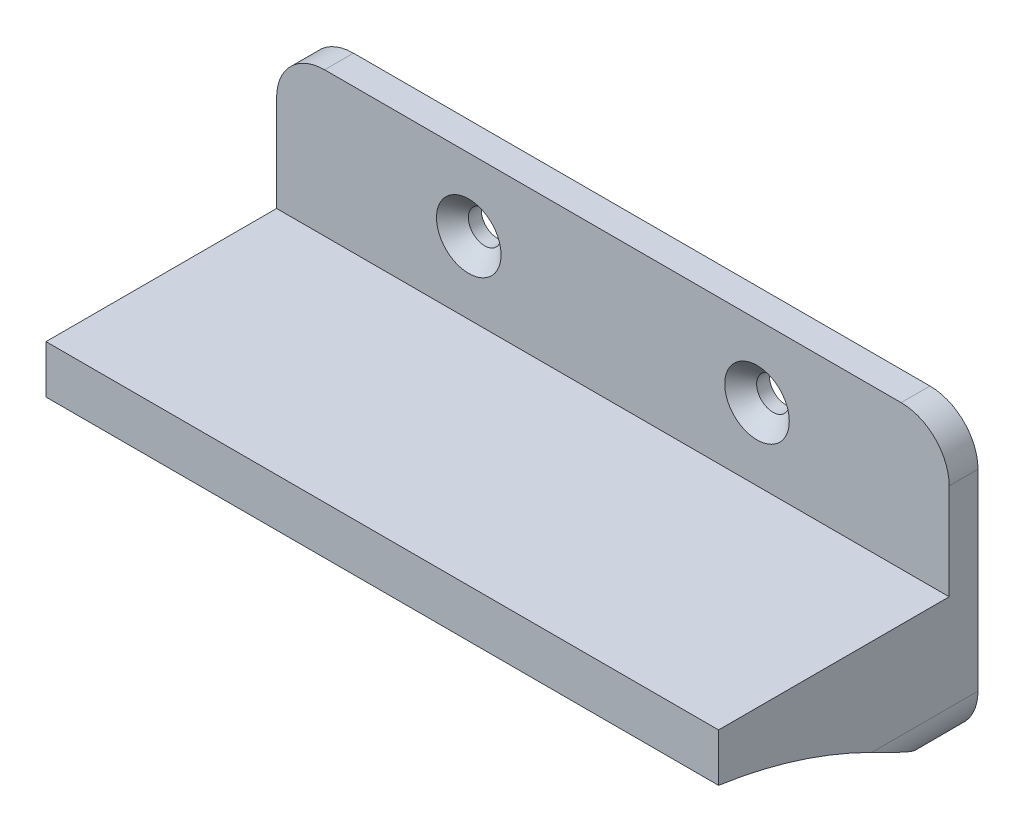
ISO-10303-21;
HEADER;
FILE_DESCRIPTION(('STEP AP214'),'2;1');
FILE_NAME('part.step','',(''),(''),'','','');
FILE_SCHEMA(('AUTOMOTIVE_DESIGN { 1 0 10303 214 1 1 1 1 }'));
ENDSEC;
DATA;
#1=APPLICATION_CONTEXT('core data for automotive mechanical design processes');
#2=APPLICATION_PROTOCOL_DEFINITION('international standard','automotive_design',2000,#1);
#3=PRODUCT_CONTEXT('',#1,'mechanical');
#4=PRODUCT('Part','Part','',(#3));
#5=PRODUCT_RELATED_PRODUCT_CATEGORY('part','',(#4));
#6=PRODUCT_DEFINITION_FORMATION('','',#4);
#7=PRODUCT_DEFINITION_CONTEXT('part definition',#1,'design');
#8=PRODUCT_DEFINITION('design','',#6,#7);
#9=PRODUCT_DEFINITION_SHAPE('','',#8);
#10=(LENGTH_UNIT() NAMED_UNIT(*) SI_UNIT(.MILLI.,.METRE.));
#11=(NAMED_UNIT(*) PLANE_ANGLE_UNIT() SI_UNIT($,.RADIAN.));
#12=(NAMED_UNIT(*) SI_UNIT($,.STERADIAN.) SOLID_ANGLE_UNIT());
#13=UNCERTAINTY_MEASURE_WITH_UNIT(LENGTH_MEASURE(1.E-05),#10,'distance_accuracy_value','');
#14=(GEOMETRIC_REPRESENTATION_CONTEXT(3) GLOBAL_UNCERTAINTY_ASSIGNED_CONTEXT((#13)) GLOBAL_UNIT_ASSIGNED_CONTEXT((#10,
#11,#12)) REPRESENTATION_CONTEXT('',''));
#15=CARTESIAN_POINT('',(0.,0.,0.));
#16=DIRECTION('',(0.,0.,1.));
#17=DIRECTION('',(1.,0.,0.));
#18=AXIS2_PLACEMENT_3D('',#15,#16,#17);
#19=CARTESIAN_POINT('',(0.,0.,3.));
#20=DIRECTION('',(0.,0.,1.));
#21=DIRECTION('',(1.,0.,0.));
#22=AXIS2_PLACEMENT_3D('',#19,#20,#21);
#23=PLANE('',#22);
#24=CARTESIAN_POINT('',(-9.92366412213741,7.99618320610687,3.));
#25=DIRECTION('',(0.,0.,1.));
#26=DIRECTION('',(1.,0.,0.));
#27=AXIS2_PLACEMENT_3D('',#24,#25,#26);
#28=CIRCLE('',#27,3.36);
#29=CARTESIAN_POINT('',(-6.56366412213741,7.99618320610687,3.));
#30=VERTEX_POINT('',#29);
#31=EDGE_CURVE('E459',#30,#30,#28,.T.);
#32=ORIENTED_EDGE('',*,*,#31,.F.);
#33=EDGE_LOOP('',(#32));
#34=FACE_BOUND('',#33,.T.);
#35=CARTESIAN_POINT('',(20.0763358778626,7.99618320610689,3.));
#36=DIRECTION('',(0.,0.,1.));
#37=DIRECTION('',(1.,0.,0.));
#38=AXIS2_PLACEMENT_3D('',#35,#36,#37);
#39=CIRCLE('',#38,3.36);
#40=CARTESIAN_POINT('',(23.4363358778626,7.99618320610689,3.));
#41=VERTEX_POINT('',#40);
#42=EDGE_CURVE('E450',#41,#41,#39,.T.);
#43=ORIENTED_EDGE('',*,*,#42,.F.);
#44=EDGE_LOOP('',(#43));
#45=FACE_BOUND('',#44,.T.);
#46=DIRECTION('',(0.,1.,0.));
#47=VECTOR('',#46,1.);
#48=CARTESIAN_POINT('',(40.0763358778626,15.4961832061069,3.));
#49=LINE('',#48,#47);
#50=CARTESIAN_POINT('',(40.0763358778626,0.496183206106872,3.));
#51=VERTEX_POINT('',#50);
#52=CARTESIAN_POINT('',(40.0763358778626,10.4961832061069,3.));
#53=VERTEX_POINT('',#52);
#54=EDGE_CURVE('E283',#51,#53,#49,.T.);
#55=ORIENTED_EDGE('',*,*,#54,.T.);
#56=CARTESIAN_POINT('',(35.0763358778626,10.4961832061069,3.));
#57=DIRECTION('',(0.,0.,1.));
#58=DIRECTION('',(1.,0.,0.));
#59=AXIS2_PLACEMENT_3D('',#56,#57,#58);
#60=CIRCLE('',#59,5.);
#61=CARTESIAN_POINT('',(35.0763358778626,15.4961832061069,3.));
#62=VERTEX_POINT('',#61);
#63=EDGE_CURVE('E11',#53,#62,#60,.T.);
#64=ORIENTED_EDGE('',*,*,#63,.T.);
#65=DIRECTION('',(-1.,0.,0.));
#66=VECTOR('',#65,1.);
#67=CARTESIAN_POINT('',(-29.9236641221374,15.4961832061069,3.));
#68=LINE('',#67,#66);
#69=CARTESIAN_POINT('',(-24.9236641221374,15.4961832061069,3.));
#70=VERTEX_POINT('',#69);
#71=EDGE_CURVE('E188',#62,#70,#68,.T.);
#72=ORIENTED_EDGE('',*,*,#71,.T.);
#73=CARTESIAN_POINT('',(-24.9236641221374,10.4961832061069,3.));
#74=DIRECTION('',(0.,0.,1.));
#75=DIRECTION('',(1.,0.,0.));
#76=AXIS2_PLACEMENT_3D('',#73,#74,#75);
#77=CIRCLE('',#76,5.);
#78=CARTESIAN_POINT('',(-29.9236641221374,10.4961832061069,3.));
#79=VERTEX_POINT('',#78);
#80=EDGE_CURVE('E41',#70,#79,#77,.T.);
#81=ORIENTED_EDGE('',*,*,#80,.T.);
#82=DIRECTION('',(0.,-1.,0.));
#83=VECTOR('',#82,1.);
#84=CARTESIAN_POINT('',(-29.9236641221374,15.4961832061069,3.));
#85=LINE('',#84,#83);
#86=CARTESIAN_POINT('',(-29.9236641221374,0.496183206106872,3.));
#87=VERTEX_POINT('',#86);
#88=EDGE_CURVE('E275',#79,#87,#85,.T.);
#89=ORIENTED_EDGE('',*,*,#88,.T.);
#90=DIRECTION('',(-1.,0.,0.));
#91=VECTOR('',#90,1.);
#92=CARTESIAN_POINT('',(-29.9236641221374,0.496183206106873,3.));
#93=LINE('',#92,#91);
#94=EDGE_CURVE('E208',#51,#87,#93,.T.);
#95=ORIENTED_EDGE('',*,*,#94,.F.);
#96=EDGE_LOOP('',(#55,#64,#72,#81,#89,#95));
#97=FACE_BOUND('',#96,.T.);
#98=ADVANCED_FACE('F33',(#34,#45,#97),#23,.T.);
#99=DIRECTION('',(1.,0.,0.));
#100=VECTOR('',#99,1.);
#101=CARTESIAN_POINT('',(-29.9236641221374,-14.5038167938931,3.));
#102=LINE('',#101,#100);
#103=CARTESIAN_POINT('',(18.0763358778626,-14.5038167938931,3.00000000000001));
#104=VERTEX_POINT('',#103);
#105=CARTESIAN_POINT('',(35.0763358778626,-14.5038167938931,3.));
#106=VERTEX_POINT('',#105);
#107=EDGE_CURVE('E277',#104,#106,#102,.T.);
#108=ORIENTED_EDGE('',*,*,#107,.T.);
#109=CARTESIAN_POINT('',(35.0763358778626,-9.50381679389312,3.));
#110=DIRECTION('',(0.,0.,1.));
#111=DIRECTION('',(1.,0.,0.));
#112=AXIS2_PLACEMENT_3D('',#109,#110,#111);
#113=CIRCLE('',#112,5.);
#114=CARTESIAN_POINT('',(36.0763358778626,-14.4027962794595,3.));
#115=VERTEX_POINT('',#114);
#116=EDGE_CURVE('E312',#106,#115,#113,.T.);
#117=ORIENTED_EDGE('',*,*,#116,.T.);
#118=DIRECTION('',(0.,-1.,0.));
#119=VECTOR('',#118,1.);
#120=CARTESIAN_POINT('',(36.0763358778626,-4.50381679389313,3.));
#121=LINE('',#120,#119);
#122=CARTESIAN_POINT('',(36.0763358778626,-4.50381679389313,3.));
#123=VERTEX_POINT('',#122);
#124=EDGE_CURVE('E213',#123,#115,#121,.T.);
#125=ORIENTED_EDGE('',*,*,#124,.F.);
#126=DIRECTION('',(1.,0.,0.));
#127=VECTOR('',#126,1.);
#128=CARTESIAN_POINT('',(18.0763358778626,-4.50381679389313,3.));
#129=LINE('',#128,#127);
#130=CARTESIAN_POINT('',(18.0763358778626,-4.50381679389313,3.));
#131=VERTEX_POINT('',#130);
#132=EDGE_CURVE('E247',#131,#123,#129,.T.);
#133=ORIENTED_EDGE('',*,*,#132,.F.);
#134=DIRECTION('',(0.,1.,0.));
#135=VECTOR('',#134,1.);
#136=CARTESIAN_POINT('',(18.0763358778626,-4.50381679389313,3.));
#137=LINE('',#136,#135);
#138=EDGE_CURVE('E244',#104,#131,#137,.T.);
#139=ORIENTED_EDGE('',*,*,#138,.F.);
#140=EDGE_LOOP('',(#108,#117,#125,#133,#139));
#141=FACE_BOUND('',#140,.T.);
#142=ADVANCED_FACE('F361',(#141),#23,.T.);
#143=DIRECTION('',(0.,-1.,0.));
#144=VECTOR('',#143,1.);
#145=CARTESIAN_POINT('',(14.0763358778626,-4.50381679389313,3.));
#146=LINE('',#145,#144);
#147=CARTESIAN_POINT('',(14.0763358778626,-4.50381679389313,3.));
#148=VERTEX_POINT('',#147);
#149=CARTESIAN_POINT('',(14.0763358778626,-14.5038167938931,3.00000000000001));
#150=VERTEX_POINT('',#149);
#151=EDGE_CURVE('E241',#148,#150,#146,.T.);
#152=ORIENTED_EDGE('',*,*,#151,.F.);
#153=DIRECTION('',(1.,0.,0.));
#154=VECTOR('',#153,1.);
#155=CARTESIAN_POINT('',(-3.92366412213741,-4.50381679389313,3.));
#156=LINE('',#155,#154);
#157=CARTESIAN_POINT('',(-3.92366412213741,-4.50381679389313,3.));
#158=VERTEX_POINT('',#157);
#159=EDGE_CURVE('E238',#158,#148,#156,.T.);
#160=ORIENTED_EDGE('',*,*,#159,.F.);
#161=DIRECTION('',(0.,1.,0.));
#162=VECTOR('',#161,1.);
#163=CARTESIAN_POINT('',(-3.92366412213741,-4.50381679389313,3.));
#164=LINE('',#163,#162);
#165=CARTESIAN_POINT('',(-3.92366412213741,-14.5038167938931,3.00000000000001));
#166=VERTEX_POINT('',#165);
#167=EDGE_CURVE('E235',#166,#158,#164,.T.);
#168=ORIENTED_EDGE('',*,*,#167,.F.);
#169=EDGE_CURVE('E281',#166,#150,#102,.T.);
#170=ORIENTED_EDGE('',*,*,#169,.T.);
#171=EDGE_LOOP('',(#152,#160,#168,#170));
#172=FACE_BOUND('',#171,.T.);
#173=ADVANCED_FACE('F368',(#172),#23,.T.);
#174=CARTESIAN_POINT('',(-29.9236641221374,15.4961832061069,3.));
#175=DIRECTION('',(1.,0.,0.));
#176=DIRECTION('',(0.,0.,-1.));
#177=AXIS2_PLACEMENT_3D('',#174,#175,#176);
#178=PLANE('',#177);
#179=DIRECTION('',(0.,-1.,0.));
#180=VECTOR('',#179,1.);
#181=CARTESIAN_POINT('',(-29.9236641221374,15.4961832061069,0.));
#182=LINE('',#181,#180);
#183=CARTESIAN_POINT('',(-29.9236641221374,10.4961832061069,0.));
#184=VERTEX_POINT('',#183);
#185=CARTESIAN_POINT('',(-29.9236641221374,-9.50381679389313,0.));
#186=VERTEX_POINT('',#185);
#187=EDGE_CURVE('E274',#184,#186,#182,.T.);
#188=ORIENTED_EDGE('',*,*,#187,.T.);
#189=DIRECTION('',(0.,0.,-1.));
#190=VECTOR('',#189,1.);
#191=CARTESIAN_POINT('',(-29.9236641221374,-9.50381679389313,3.));
#192=LINE('',#191,#190);
#193=CARTESIAN_POINT('',(-29.9236641221374,-9.50381679389313,11.0521277313624));
#194=VERTEX_POINT('',#193);
#195=EDGE_CURVE('E198',#186,#194,#192,.F.);
#196=ORIENTED_EDGE('',*,*,#195,.T.);
#197=CARTESIAN_POINT('',(-29.9236641221374,-56.1358132044966,34.4299985044181));
#198=DIRECTION('',(-1.,0.,0.));
#199=DIRECTION('',(0.,0.,-1.));
#200=AXIS2_PLACEMENT_3D('',#197,#198,#199);
#201=CIRCLE('',#200,52.1638565591179);
#202=CARTESIAN_POINT('',(-29.9236641221374,-4.50381679389313,27.));
#203=VERTEX_POINT('',#202);
#204=EDGE_CURVE('E179',#203,#194,#201,.T.);
#205=ORIENTED_EDGE('',*,*,#204,.F.);
#206=DIRECTION('',(0.,-1.,0.));
#207=VECTOR('',#206,1.);
#208=CARTESIAN_POINT('',(-29.9236641221374,0.496183206106873,27.));
#209=LINE('',#208,#207);
#210=CARTESIAN_POINT('',(-29.9236641221374,0.496183206106873,27.));
#211=VERTEX_POINT('',#210);
#212=EDGE_CURVE('E196',#211,#203,#209,.T.);
#213=ORIENTED_EDGE('',*,*,#212,.F.);
#214=DIRECTION('',(0.,0.,-1.));
#215=VECTOR('',#214,1.);
#216=CARTESIAN_POINT('',(-29.9236641221374,0.496183206106873,27.));
#217=LINE('',#216,#215);
#218=EDGE_CURVE('E226',#211,#87,#217,.T.);
#219=ORIENTED_EDGE('',*,*,#218,.T.);
#220=ORIENTED_EDGE('',*,*,#88,.F.);
#221=DIRECTION('',(0.,0.,-1.));
#222=VECTOR('',#221,1.);
#223=CARTESIAN_POINT('',(-29.9236641221374,10.4961832061069,3.));
#224=LINE('',#223,#222);
#225=EDGE_CURVE('E324',#79,#184,#224,.T.);
#226=ORIENTED_EDGE('',*,*,#225,.T.);
#227=EDGE_LOOP('',(#188,#196,#205,#213,#219,#220,#226));
#228=FACE_BOUND('',#227,.T.);
#229=ADVANCED_FACE('F194',(#228),#178,.F.);
#230=CARTESIAN_POINT('',(-29.9236641221374,-14.5038167938931,3.));
#231=DIRECTION('',(0.,1.,0.));
#232=DIRECTION('',(0.,0.,1.));
#233=AXIS2_PLACEMENT_3D('',#230,#231,#232);
#234=PLANE('',#233);
#235=DIRECTION('',(1.,0.,0.));
#236=VECTOR('',#235,1.);
#237=CARTESIAN_POINT('',(-29.9236641221374,-14.5038167938931,0.));
#238=LINE('',#237,#236);
#239=CARTESIAN_POINT('',(-24.9236641221374,-14.5038167938931,0.));
#240=VERTEX_POINT('',#239);
#241=CARTESIAN_POINT('',(35.0763358778626,-14.5038167938931,0.));
#242=VERTEX_POINT('',#241);
#243=EDGE_CURVE('E287',#240,#242,#238,.T.);
#244=ORIENTED_EDGE('',*,*,#243,.T.);
#245=DIRECTION('',(0.,0.,-1.));
#246=VECTOR('',#245,1.);
#247=CARTESIAN_POINT('',(35.0763358778626,-14.5038167938931,3.));
#248=LINE('',#247,#246);
#249=EDGE_CURVE('E310',#242,#106,#248,.F.);
#250=ORIENTED_EDGE('',*,*,#249,.T.);
#251=ORIENTED_EDGE('',*,*,#107,.F.);
#252=DIRECTION('',(-1.,0.,0.));
#253=VECTOR('',#252,1.);
#254=CARTESIAN_POINT('',(40.0763358778626,-14.5038167938931,3.00000000000001));
#255=LINE('',#254,#253);
#256=EDGE_CURVE('E426',#104,#150,#255,.T.);
#257=ORIENTED_EDGE('',*,*,#256,.T.);
#258=ORIENTED_EDGE('',*,*,#169,.F.);
#259=CARTESIAN_POINT('',(-7.92366412213741,-14.5038167938931,3.00000000000001));
#260=VERTEX_POINT('',#259);
#261=EDGE_CURVE('E424',#166,#260,#255,.T.);
#262=ORIENTED_EDGE('',*,*,#261,.T.);
#263=CARTESIAN_POINT('',(-24.9236641221374,-14.5038167938931,3.));
#264=VERTEX_POINT('',#263);
#265=EDGE_CURVE('E282',#264,#260,#102,.T.);
#266=ORIENTED_EDGE('',*,*,#265,.F.);
#267=DIRECTION('',(0.,0.,-1.));
#268=VECTOR('',#267,1.);
#269=CARTESIAN_POINT('',(-24.9236641221374,-14.5038167938931,3.));
#270=LINE('',#269,#268);
#271=EDGE_CURVE('E307',#264,#240,#270,.T.);
#272=ORIENTED_EDGE('',*,*,#271,.T.);
#273=EDGE_LOOP('',(#244,#250,#251,#257,#258,#262,#266,#272));
#274=FACE_BOUND('',#273,.T.);
#275=ADVANCED_FACE('F392',(#274),#234,.F.);
#276=CARTESIAN_POINT('',(40.0763358778626,15.4961832061069,3.));
#277=DIRECTION('',(-1.,0.,0.));
#278=DIRECTION('',(0.,-1.,0.));
#279=AXIS2_PLACEMENT_3D('',#276,#277,#278);
#280=PLANE('',#279);
#281=CARTESIAN_POINT('',(40.0763358778626,-56.1358132044966,34.4299985044181));
#282=DIRECTION('',(-1.,0.,0.));
#283=DIRECTION('',(0.,0.,-1.));
#284=AXIS2_PLACEMENT_3D('',#281,#282,#283);
#285=CIRCLE('',#284,52.1638565591179);
#286=CARTESIAN_POINT('',(40.0763358778626,-4.50381679389313,27.));
#287=VERTEX_POINT('',#286);
#288=CARTESIAN_POINT('',(40.0763358778626,-9.50381679389312,11.0521277313625));
#289=VERTEX_POINT('',#288);
#290=EDGE_CURVE('E199',#287,#289,#285,.T.);
#291=ORIENTED_EDGE('',*,*,#290,.T.);
#292=DIRECTION('',(0.,0.,-1.));
#293=VECTOR('',#292,1.);
#294=CARTESIAN_POINT('',(40.0763358778626,-9.50381679389312,3.));
#295=LINE('',#294,#293);
#296=CARTESIAN_POINT('',(40.0763358778626,-9.50381679389312,0.));
#297=VERTEX_POINT('',#296);
#298=EDGE_CURVE('E296',#289,#297,#295,.T.);
#299=ORIENTED_EDGE('',*,*,#298,.T.);
#300=DIRECTION('',(0.,1.,0.));
#301=VECTOR('',#300,1.);
#302=CARTESIAN_POINT('',(40.0763358778626,15.4961832061069,0.));
#303=LINE('',#302,#301);
#304=CARTESIAN_POINT('',(40.0763358778626,10.4961832061069,0.));
#305=VERTEX_POINT('',#304);
#306=EDGE_CURVE('E290',#297,#305,#303,.T.);
#307=ORIENTED_EDGE('',*,*,#306,.T.);
#308=DIRECTION('',(0.,0.,-1.));
#309=VECTOR('',#308,1.);
#310=CARTESIAN_POINT('',(40.0763358778626,10.4961832061069,3.));
#311=LINE('',#310,#309);
#312=EDGE_CURVE('E294',#305,#53,#311,.F.);
#313=ORIENTED_EDGE('',*,*,#312,.T.);
#314=ORIENTED_EDGE('',*,*,#54,.F.);
#315=DIRECTION('',(0.,0.,-1.));
#316=VECTOR('',#315,1.);
#317=CARTESIAN_POINT('',(40.0763358778626,0.496183206106873,27.));
#318=LINE('',#317,#316);
#319=CARTESIAN_POINT('',(40.0763358778626,0.496183206106873,27.));
#320=VERTEX_POINT('',#319);
#321=EDGE_CURVE('E253',#320,#51,#318,.T.);
#322=ORIENTED_EDGE('',*,*,#321,.F.);
#323=DIRECTION('',(0.,1.,0.));
#324=VECTOR('',#323,1.);
#325=CARTESIAN_POINT('',(40.0763358778626,-4.50381679389313,27.));
#326=LINE('',#325,#324);
#327=EDGE_CURVE('E223',#287,#320,#326,.T.);
#328=ORIENTED_EDGE('',*,*,#327,.F.);
#329=EDGE_LOOP('',(#291,#299,#307,#313,#314,#322,#328));
#330=FACE_BOUND('',#329,.T.);
#331=ADVANCED_FACE('F384',(#330),#280,.F.);
#332=CARTESIAN_POINT('',(-29.9236641221374,15.4961832061069,3.));
#333=DIRECTION('',(0.,-1.,0.));
#334=DIRECTION('',(0.,0.,-1.));
#335=AXIS2_PLACEMENT_3D('',#332,#333,#334);
#336=PLANE('',#335);
#337=ORIENTED_EDGE('',*,*,#71,.F.);
#338=DIRECTION('',(0.,0.,-1.));
#339=VECTOR('',#338,1.);
#340=CARTESIAN_POINT('',(35.0763358778626,15.4961832061069,3.));
#341=LINE('',#340,#339);
#342=CARTESIAN_POINT('',(35.0763358778626,15.4961832061069,0.));
#343=VERTEX_POINT('',#342);
#344=EDGE_CURVE('E491',#62,#343,#341,.T.);
#345=ORIENTED_EDGE('',*,*,#344,.T.);
#346=DIRECTION('',(-1.,0.,0.));
#347=VECTOR('',#346,1.);
#348=CARTESIAN_POINT('',(-29.9236641221374,15.4961832061069,0.));
#349=LINE('',#348,#347);
#350=CARTESIAN_POINT('',(-24.9236641221374,15.4961832061069,0.));
#351=VERTEX_POINT('',#350);
#352=EDGE_CURVE('E278',#343,#351,#349,.T.);
#353=ORIENTED_EDGE('',*,*,#352,.T.);
#354=DIRECTION('',(0.,0.,-1.));
#355=VECTOR('',#354,1.);
#356=CARTESIAN_POINT('',(-24.9236641221374,15.4961832061069,3.));
#357=LINE('',#356,#355);
#358=EDGE_CURVE('E48',#351,#70,#357,.F.);
#359=ORIENTED_EDGE('',*,*,#358,.T.);
#360=EDGE_LOOP('',(#337,#345,#353,#359));
#361=FACE_BOUND('',#360,.T.);
#362=ADVANCED_FACE('F376',(#361),#336,.F.);
#363=DIRECTION('',(0.,1.,0.));
#364=VECTOR('',#363,1.);
#365=CARTESIAN_POINT('',(-25.9236641221374,-4.50381679389313,3.));
#366=LINE('',#365,#364);
#367=CARTESIAN_POINT('',(-25.9236641221374,-14.4027962794595,3.));
#368=VERTEX_POINT('',#367);
#369=CARTESIAN_POINT('',(-25.9236641221374,-4.50381679389313,3.));
#370=VERTEX_POINT('',#369);
#371=EDGE_CURVE('E227',#368,#370,#366,.T.);
#372=ORIENTED_EDGE('',*,*,#371,.F.);
#373=CARTESIAN_POINT('',(-24.9236641221374,-9.50381679389313,3.));
#374=DIRECTION('',(0.,0.,1.));
#375=DIRECTION('',(1.,0.,0.));
#376=AXIS2_PLACEMENT_3D('',#373,#374,#375);
#377=CIRCLE('',#376,5.);
#378=EDGE_CURVE('E429',#368,#264,#377,.T.);
#379=ORIENTED_EDGE('',*,*,#378,.T.);
#380=ORIENTED_EDGE('',*,*,#265,.T.);
#381=DIRECTION('',(0.,-1.,0.));
#382=VECTOR('',#381,1.);
#383=CARTESIAN_POINT('',(-7.92366412213741,-4.50381679389313,3.));
#384=LINE('',#383,#382);
#385=CARTESIAN_POINT('',(-7.92366412213741,-4.50381679389313,3.));
#386=VERTEX_POINT('',#385);
#387=EDGE_CURVE('E232',#386,#260,#384,.T.);
#388=ORIENTED_EDGE('',*,*,#387,.F.);
#389=DIRECTION('',(1.,0.,0.));
#390=VECTOR('',#389,1.);
#391=CARTESIAN_POINT('',(-25.9236641221374,-4.50381679389313,3.));
#392=LINE('',#391,#390);
#393=EDGE_CURVE('E229',#370,#386,#392,.T.);
#394=ORIENTED_EDGE('',*,*,#393,.F.);
#395=EDGE_LOOP('',(#372,#379,#380,#388,#394));
#396=FACE_BOUND('',#395,.T.);
#397=ADVANCED_FACE('F364',(#396),#23,.T.);
#398=CARTESIAN_POINT('',(0.,0.,0.));
#399=DIRECTION('',(0.,0.,1.));
#400=DIRECTION('',(1.,0.,0.));
#401=AXIS2_PLACEMENT_3D('',#398,#399,#400);
#402=PLANE('',#401);
#403=CARTESIAN_POINT('',(-9.92366412213741,7.99618320610687,0.));
#404=DIRECTION('',(0.,0.,1.));
#405=DIRECTION('',(1.,0.,0.));
#406=AXIS2_PLACEMENT_3D('',#403,#404,#405);
#407=CIRCLE('',#406,1.7);
#408=CARTESIAN_POINT('',(-8.22366412213741,7.99618320610687,0.));
#409=VERTEX_POINT('',#408);
#410=EDGE_CURVE('E453',#409,#409,#407,.T.);
#411=ORIENTED_EDGE('',*,*,#410,.T.);
#412=EDGE_LOOP('',(#411));
#413=FACE_BOUND('',#412,.T.);
#414=CARTESIAN_POINT('',(20.0763358778626,7.99618320610689,0.));
#415=DIRECTION('',(0.,0.,1.));
#416=DIRECTION('',(1.,0.,0.));
#417=AXIS2_PLACEMENT_3D('',#414,#415,#416);
#418=CIRCLE('',#417,1.7);
#419=CARTESIAN_POINT('',(21.7763358778626,7.99618320610689,0.));
#420=VERTEX_POINT('',#419);
#421=EDGE_CURVE('E200',#420,#420,#418,.T.);
#422=ORIENTED_EDGE('',*,*,#421,.T.);
#423=EDGE_LOOP('',(#422));
#424=FACE_BOUND('',#423,.T.);
#425=ORIENTED_EDGE('',*,*,#306,.F.);
#426=CARTESIAN_POINT('',(35.0763358778626,-9.50381679389312,0.));
#427=DIRECTION('',(0.,0.,1.));
#428=DIRECTION('',(1.,0.,0.));
#429=AXIS2_PLACEMENT_3D('',#426,#427,#428);
#430=CIRCLE('',#429,5.);
#431=EDGE_CURVE('E305',#297,#242,#430,.F.);
#432=ORIENTED_EDGE('',*,*,#431,.T.);
#433=ORIENTED_EDGE('',*,*,#243,.F.);
#434=CARTESIAN_POINT('',(-24.9236641221374,-9.50381679389313,0.));
#435=DIRECTION('',(0.,0.,1.));
#436=DIRECTION('',(1.,0.,0.));
#437=AXIS2_PLACEMENT_3D('',#434,#435,#436);
#438=CIRCLE('',#437,5.);
#439=EDGE_CURVE('E303',#240,#186,#438,.F.);
#440=ORIENTED_EDGE('',*,*,#439,.T.);
#441=ORIENTED_EDGE('',*,*,#187,.F.);
#442=CARTESIAN_POINT('',(-24.9236641221374,10.4961832061069,0.));
#443=DIRECTION('',(0.,0.,1.));
#444=DIRECTION('',(1.,0.,0.));
#445=AXIS2_PLACEMENT_3D('',#442,#443,#444);
#446=CIRCLE('',#445,5.);
#447=EDGE_CURVE('E299',#184,#351,#446,.F.);
#448=ORIENTED_EDGE('',*,*,#447,.T.);
#449=ORIENTED_EDGE('',*,*,#352,.F.);
#450=CARTESIAN_POINT('',(35.0763358778626,10.4961832061069,0.));
#451=DIRECTION('',(0.,0.,1.));
#452=DIRECTION('',(1.,0.,0.));
#453=AXIS2_PLACEMENT_3D('',#450,#451,#452);
#454=CIRCLE('',#453,5.);
#455=EDGE_CURVE('E301',#343,#305,#454,.F.);
#456=ORIENTED_EDGE('',*,*,#455,.T.);
#457=EDGE_LOOP('',(#425,#432,#433,#440,#441,#448,#449,#456));
#458=FACE_BOUND('',#457,.T.);
#459=ADVANCED_FACE('F375',(#413,#424,#458),#402,.F.);
#460=CARTESIAN_POINT('',(-25.9236641221374,-4.50381679389313,27.));
#461=DIRECTION('',(-1.,0.,0.));
#462=DIRECTION('',(0.,0.,1.));
#463=AXIS2_PLACEMENT_3D('',#460,#461,#462);
#464=PLANE('',#463);
#465=CARTESIAN_POINT('',(-25.9236641221374,-56.1358132044966,34.4299985044181));
#466=DIRECTION('',(-1.,0.,0.));
#467=DIRECTION('',(0.,0.,1.));
#468=AXIS2_PLACEMENT_3D('',#465,#466,#467);
#469=CIRCLE('',#468,52.1638565591179);
#470=CARTESIAN_POINT('',(-25.9236641221374,-4.50381679389313,27.));
#471=VERTEX_POINT('',#470);
#472=CARTESIAN_POINT('',(-25.9236641221374,-14.4027962794595,3.13426030486783));
#473=VERTEX_POINT('',#472);
#474=EDGE_CURVE('E182',#471,#473,#469,.T.);
#475=ORIENTED_EDGE('',*,*,#474,.T.);
#476=DIRECTION('',(0.,0.,-1.));
#477=VECTOR('',#476,1.);
#478=CARTESIAN_POINT('',(-25.9236641221374,-14.4027962794595,3.13426030486783));
#479=LINE('',#478,#477);
#480=EDGE_CURVE('E347',#473,#368,#479,.T.);
#481=ORIENTED_EDGE('',*,*,#480,.T.);
#482=ORIENTED_EDGE('',*,*,#371,.T.);
#483=DIRECTION('',(0.,0.,-1.));
#484=VECTOR('',#483,1.);
#485=CARTESIAN_POINT('',(-25.9236641221374,-4.50381679389313,27.));
#486=LINE('',#485,#484);
#487=EDGE_CURVE('E271',#471,#370,#486,.T.);
#488=ORIENTED_EDGE('',*,*,#487,.F.);
#489=EDGE_LOOP('',(#475,#481,#482,#488));
#490=FACE_BOUND('',#489,.T.);
#491=ADVANCED_FACE('F382',(#490),#464,.F.);
#492=CARTESIAN_POINT('',(-25.9236641221374,-4.50381679389313,27.));
#493=DIRECTION('',(0.,1.,0.));
#494=DIRECTION('',(0.,0.,1.));
#495=AXIS2_PLACEMENT_3D('',#492,#493,#494);
#496=PLANE('',#495);
#497=ORIENTED_EDGE('',*,*,#393,.T.);
#498=DIRECTION('',(0.,0.,-1.));
#499=VECTOR('',#498,1.);
#500=CARTESIAN_POINT('',(-7.92366412213741,-4.50381679389313,27.));
#501=LINE('',#500,#499);
#502=CARTESIAN_POINT('',(-7.92366412213741,-4.50381679389313,27.));
#503=VERTEX_POINT('',#502);
#504=EDGE_CURVE('E268',#503,#386,#501,.T.);
#505=ORIENTED_EDGE('',*,*,#504,.F.);
#506=DIRECTION('',(1.,0.,0.));
#507=VECTOR('',#506,1.);
#508=CARTESIAN_POINT('',(-25.9236641221374,-4.50381679389313,27.));
#509=LINE('',#508,#507);
#510=EDGE_CURVE('E207',#471,#503,#509,.T.);
#511=ORIENTED_EDGE('',*,*,#510,.F.);
#512=ORIENTED_EDGE('',*,*,#487,.T.);
#513=EDGE_LOOP('',(#497,#505,#511,#512));
#514=FACE_BOUND('',#513,.T.);
#515=ADVANCED_FACE('F587',(#514),#496,.F.);
#516=CARTESIAN_POINT('',(-7.92366412213741,-4.50381679389313,27.));
#517=DIRECTION('',(1.,0.,0.));
#518=DIRECTION('',(0.,0.,-1.));
#519=AXIS2_PLACEMENT_3D('',#516,#517,#518);
#520=PLANE('',#519);
#521=ORIENTED_EDGE('',*,*,#387,.T.);
#522=CARTESIAN_POINT('',(-7.92366412213741,-56.1358132044966,34.4299985044181));
#523=DIRECTION('',(1.,0.,0.));
#524=DIRECTION('',(0.,0.,-1.));
#525=AXIS2_PLACEMENT_3D('',#522,#523,#524);
#526=CIRCLE('',#525,52.1638565591179);
#527=EDGE_CURVE('E431',#260,#503,#526,.T.);
#528=ORIENTED_EDGE('',*,*,#527,.T.);
#529=ORIENTED_EDGE('',*,*,#504,.T.);
#530=EDGE_LOOP('',(#521,#528,#529));
#531=FACE_BOUND('',#530,.T.);
#532=ADVANCED_FACE('F580',(#531),#520,.F.);
#533=CARTESIAN_POINT('',(-3.92366412213741,-4.50381679389313,27.));
#534=DIRECTION('',(-1.,0.,0.));
#535=DIRECTION('',(0.,0.,1.));
#536=AXIS2_PLACEMENT_3D('',#533,#534,#535);
#537=PLANE('',#536);
#538=DIRECTION('',(0.,0.,-1.));
#539=VECTOR('',#538,1.);
#540=CARTESIAN_POINT('',(-3.92366412213741,-4.50381679389313,27.));
#541=LINE('',#540,#539);
#542=CARTESIAN_POINT('',(-3.92366412213741,-4.50381679389313,27.));
#543=VERTEX_POINT('',#542);
#544=EDGE_CURVE('E265',#543,#158,#541,.T.);
#545=ORIENTED_EDGE('',*,*,#544,.F.);
#546=CARTESIAN_POINT('',(-3.92366412213741,-56.1358132044966,34.4299985044181));
#547=DIRECTION('',(-1.,0.,0.));
#548=DIRECTION('',(0.,0.,1.));
#549=AXIS2_PLACEMENT_3D('',#546,#547,#548);
#550=CIRCLE('',#549,52.1638565591179);
#551=EDGE_CURVE('E407',#543,#166,#550,.T.);
#552=ORIENTED_EDGE('',*,*,#551,.T.);
#553=ORIENTED_EDGE('',*,*,#167,.T.);
#554=EDGE_LOOP('',(#545,#552,#553));
#555=FACE_BOUND('',#554,.T.);
#556=ADVANCED_FACE('F420',(#555),#537,.F.);
#557=CARTESIAN_POINT('',(-3.92366412213741,-4.50381679389313,27.));
#558=DIRECTION('',(0.,1.,0.));
#559=DIRECTION('',(0.,0.,1.));
#560=AXIS2_PLACEMENT_3D('',#557,#558,#559);
#561=PLANE('',#560);
#562=ORIENTED_EDGE('',*,*,#159,.T.);
#563=DIRECTION('',(0.,0.,-1.));
#564=VECTOR('',#563,1.);
#565=CARTESIAN_POINT('',(14.0763358778626,-4.50381679389313,27.));
#566=LINE('',#565,#564);
#567=CARTESIAN_POINT('',(14.0763358778626,-4.50381679389313,27.));
#568=VERTEX_POINT('',#567);
#569=EDGE_CURVE('E262',#568,#148,#566,.T.);
#570=ORIENTED_EDGE('',*,*,#569,.F.);
#571=DIRECTION('',(1.,0.,0.));
#572=VECTOR('',#571,1.);
#573=CARTESIAN_POINT('',(-3.92366412213741,-4.50381679389313,27.));
#574=LINE('',#573,#572);
#575=EDGE_CURVE('E210',#543,#568,#574,.T.);
#576=ORIENTED_EDGE('',*,*,#575,.F.);
#577=ORIENTED_EDGE('',*,*,#544,.T.);
#578=EDGE_LOOP('',(#562,#570,#576,#577));
#579=FACE_BOUND('',#578,.T.);
#580=ADVANCED_FACE('F400',(#579),#561,.F.);
#581=CARTESIAN_POINT('',(14.0763358778626,-4.50381679389313,27.));
#582=DIRECTION('',(1.,0.,0.));
#583=DIRECTION('',(0.,0.,-1.));
#584=AXIS2_PLACEMENT_3D('',#581,#582,#583);
#585=PLANE('',#584);
#586=ORIENTED_EDGE('',*,*,#151,.T.);
#587=CARTESIAN_POINT('',(14.0763358778626,-56.1358132044966,34.4299985044181));
#588=DIRECTION('',(1.,0.,0.));
#589=DIRECTION('',(0.,0.,-1.));
#590=AXIS2_PLACEMENT_3D('',#587,#588,#589);
#591=CIRCLE('',#590,52.1638565591179);
#592=EDGE_CURVE('E404',#150,#568,#591,.T.);
#593=ORIENTED_EDGE('',*,*,#592,.T.);
#594=ORIENTED_EDGE('',*,*,#569,.T.);
#595=EDGE_LOOP('',(#586,#593,#594));
#596=FACE_BOUND('',#595,.T.);
#597=ADVANCED_FACE('F403',(#596),#585,.F.);
#598=CARTESIAN_POINT('',(18.0763358778626,-4.50381679389313,27.));
#599=DIRECTION('',(-1.,0.,0.));
#600=DIRECTION('',(0.,0.,1.));
#601=AXIS2_PLACEMENT_3D('',#598,#599,#600);
#602=PLANE('',#601);
#603=DIRECTION('',(0.,0.,-1.));
#604=VECTOR('',#603,1.);
#605=CARTESIAN_POINT('',(18.0763358778626,-4.50381679389313,27.));
#606=LINE('',#605,#604);
#607=CARTESIAN_POINT('',(18.0763358778626,-4.50381679389313,27.));
#608=VERTEX_POINT('',#607);
#609=EDGE_CURVE('E259',#608,#131,#606,.T.);
#610=ORIENTED_EDGE('',*,*,#609,.F.);
#611=CARTESIAN_POINT('',(18.0763358778626,-56.1358132044966,34.4299985044181));
#612=DIRECTION('',(-1.,0.,0.));
#613=DIRECTION('',(0.,0.,1.));
#614=AXIS2_PLACEMENT_3D('',#611,#612,#613);
#615=CIRCLE('',#614,52.1638565591179);
#616=EDGE_CURVE('E408',#608,#104,#615,.T.);
#617=ORIENTED_EDGE('',*,*,#616,.T.);
#618=ORIENTED_EDGE('',*,*,#138,.T.);
#619=EDGE_LOOP('',(#610,#617,#618));
#620=FACE_BOUND('',#619,.T.);
#621=ADVANCED_FACE('F517',(#620),#602,.F.);
#622=CARTESIAN_POINT('',(18.0763358778626,-4.50381679389313,27.));
#623=DIRECTION('',(0.,1.,0.));
#624=DIRECTION('',(0.,0.,1.));
#625=AXIS2_PLACEMENT_3D('',#622,#623,#624);
#626=PLANE('',#625);
#627=ORIENTED_EDGE('',*,*,#132,.T.);
#628=DIRECTION('',(0.,0.,-1.));
#629=VECTOR('',#628,1.);
#630=CARTESIAN_POINT('',(36.0763358778626,-4.50381679389313,27.));
#631=LINE('',#630,#629);
#632=CARTESIAN_POINT('',(36.0763358778626,-4.50381679389313,27.));
#633=VERTEX_POINT('',#632);
#634=EDGE_CURVE('E256',#633,#123,#631,.T.);
#635=ORIENTED_EDGE('',*,*,#634,.F.);
#636=DIRECTION('',(1.,0.,0.));
#637=VECTOR('',#636,1.);
#638=CARTESIAN_POINT('',(18.0763358778626,-4.50381679389313,27.));
#639=LINE('',#638,#637);
#640=EDGE_CURVE('E220',#608,#633,#639,.T.);
#641=ORIENTED_EDGE('',*,*,#640,.F.);
#642=ORIENTED_EDGE('',*,*,#609,.T.);
#643=EDGE_LOOP('',(#627,#635,#641,#642));
#644=FACE_BOUND('',#643,.T.);
#645=ADVANCED_FACE('F511',(#644),#626,.F.);
#646=CARTESIAN_POINT('',(36.0763358778626,-4.50381679389313,27.));
#647=DIRECTION('',(1.,0.,0.));
#648=DIRECTION('',(0.,0.,-1.));
#649=AXIS2_PLACEMENT_3D('',#646,#647,#648);
#650=PLANE('',#649);
#651=ORIENTED_EDGE('',*,*,#124,.T.);
#652=DIRECTION('',(0.,0.,-1.));
#653=VECTOR('',#652,1.);
#654=CARTESIAN_POINT('',(36.0763358778626,-14.4027962794595,3.));
#655=LINE('',#654,#653);
#656=CARTESIAN_POINT('',(36.0763358778626,-14.4027962794595,3.13426030486784));
#657=VERTEX_POINT('',#656);
#658=EDGE_CURVE('E314',#115,#657,#655,.F.);
#659=ORIENTED_EDGE('',*,*,#658,.T.);
#660=CARTESIAN_POINT('',(36.0763358778626,-56.1358132044966,34.4299985044181));
#661=DIRECTION('',(1.,0.,0.));
#662=DIRECTION('',(0.,0.,-1.));
#663=AXIS2_PLACEMENT_3D('',#660,#661,#662);
#664=CIRCLE('',#663,52.1638565591179);
#665=EDGE_CURVE('E437',#657,#633,#664,.T.);
#666=ORIENTED_EDGE('',*,*,#665,.T.);
#667=ORIENTED_EDGE('',*,*,#634,.T.);
#668=EDGE_LOOP('',(#651,#659,#666,#667));
#669=FACE_BOUND('',#668,.T.);
#670=ADVANCED_FACE('F513',(#669),#650,.F.);
#671=CARTESIAN_POINT('',(-29.9236641221374,0.496183206106873,27.));
#672=DIRECTION('',(0.,-1.,0.));
#673=DIRECTION('',(0.,0.,-1.));
#674=AXIS2_PLACEMENT_3D('',#671,#672,#673);
#675=PLANE('',#674);
#676=ORIENTED_EDGE('',*,*,#94,.T.);
#677=ORIENTED_EDGE('',*,*,#218,.F.);
#678=DIRECTION('',(-1.,0.,0.));
#679=VECTOR('',#678,1.);
#680=CARTESIAN_POINT('',(-29.9236641221374,0.496183206106873,27.));
#681=LINE('',#680,#679);
#682=EDGE_CURVE('E205',#320,#211,#681,.T.);
#683=ORIENTED_EDGE('',*,*,#682,.F.);
#684=ORIENTED_EDGE('',*,*,#321,.T.);
#685=EDGE_LOOP('',(#676,#677,#683,#684));
#686=FACE_BOUND('',#685,.T.);
#687=ADVANCED_FACE('F538',(#686),#675,.F.);
#688=CARTESIAN_POINT('',(0.,0.,27.));
#689=DIRECTION('',(0.,0.,1.));
#690=DIRECTION('',(1.,0.,0.));
#691=AXIS2_PLACEMENT_3D('',#688,#689,#690);
#692=PLANE('',#691);
#693=DIRECTION('',(-1.,0.,0.));
#694=VECTOR('',#693,1.);
#695=CARTESIAN_POINT('',(40.0763358778626,-4.50381679389313,27.));
#696=LINE('',#695,#694);
#697=EDGE_CURVE('E439',#287,#633,#696,.T.);
#698=ORIENTED_EDGE('',*,*,#697,.F.);
#699=ORIENTED_EDGE('',*,*,#327,.T.);
#700=ORIENTED_EDGE('',*,*,#682,.T.);
#701=ORIENTED_EDGE('',*,*,#212,.T.);
#702=DIRECTION('',(-1.,0.,0.));
#703=VECTOR('',#702,1.);
#704=CARTESIAN_POINT('',(40.0763358778626,-4.50381679389313,27.));
#705=LINE('',#704,#703);
#706=EDGE_CURVE('E176',#471,#203,#705,.T.);
#707=ORIENTED_EDGE('',*,*,#706,.F.);
#708=ORIENTED_EDGE('',*,*,#510,.T.);
#709=EDGE_CURVE('E187',#543,#503,#705,.T.);
#710=ORIENTED_EDGE('',*,*,#709,.F.);
#711=ORIENTED_EDGE('',*,*,#575,.T.);
#712=EDGE_CURVE('E190',#608,#568,#705,.T.);
#713=ORIENTED_EDGE('',*,*,#712,.F.);
#714=ORIENTED_EDGE('',*,*,#640,.T.);
#715=EDGE_LOOP('',(#698,#699,#700,#701,#707,#708,#710,#711,#713,#714));
#716=FACE_BOUND('',#715,.T.);
#717=ADVANCED_FACE('F203',(#716),#692,.T.);
#718=CARTESIAN_POINT('',(40.0763358778626,-56.1358132044966,34.4299985044181));
#719=DIRECTION('',(-1.,0.,0.));
#720=DIRECTION('',(0.,0.,1.));
#721=AXIS2_PLACEMENT_3D('',#718,#719,#720);
#722=CYLINDRICAL_SURFACE('',#721,52.1638565591179);
#723=ORIENTED_EDGE('',*,*,#204,.T.);
#724=CARTESIAN_POINT('',(-29.9236641221374,-9.50381679389313,11.0521277313624));
#725=CARTESIAN_POINT('',(-29.9236552409525,-9.59785702571356,10.8645415266646));
#726=CARTESIAN_POINT('',(-29.9210102870231,-9.69303771105545,10.677512641665));
#727=CARTESIAN_POINT('',(-29.9100024782241,-9.88559797588627,10.304710865619));
#728=CARTESIAN_POINT('',(-29.9016383917616,-9.98297802463098,10.11893825381));
#729=CARTESIAN_POINT('',(-29.8787021932567,-10.1801926401378,9.74816023276062));
#730=CARTESIAN_POINT('',(-29.8641063460948,-10.2800352017751,9.56316051592007));
#731=CARTESIAN_POINT('',(-29.8281827628524,-10.4816638274344,9.19489126692268));
#732=CARTESIAN_POINT('',(-29.8068554678655,-10.5834497637019,9.01162162220903));
#733=CARTESIAN_POINT('',(-29.7567149483005,-10.7894826573236,8.64584461204367));
#734=CARTESIAN_POINT('',(-29.7278522501298,-10.8937415761438,8.46335070414016));
#735=CARTESIAN_POINT('',(-29.6620335702488,-11.1038075466773,8.10073160180696));
#736=CARTESIAN_POINT('',(-29.6250780730112,-11.209614505364,7.9206062662674));
#737=CARTESIAN_POINT('',(-29.5423639285985,-11.4223093026908,7.56340885632456));
#738=CARTESIAN_POINT('',(-29.4966188182348,-11.5291952428176,7.38633253728426));
#739=CARTESIAN_POINT('',(-29.3954219535354,-11.7437842036729,7.03551090869645));
#740=CARTESIAN_POINT('',(-29.3399724011329,-11.8514870337573,6.86176485341493));
#741=CARTESIAN_POINT('',(-29.2293954048893,-12.0476220364854,6.54941563688021));
#742=CARTESIAN_POINT('',(-29.1760352083595,-12.1360047836929,6.41015632510828));
#743=CARTESIAN_POINT('',(-29.0615124692757,-12.3126046229236,6.13475026310802));
#744=CARTESIAN_POINT('',(-29.0003496905171,-12.4008217098498,5.99860360725516));
#745=CARTESIAN_POINT('',(-28.8694326005799,-12.576755855976,5.72978427751965));
#746=CARTESIAN_POINT('',(-28.7996645615113,-12.6644718764102,5.59711757485702));
#747=CARTESIAN_POINT('',(-28.6508582327998,-12.8386549670721,5.33620848154109));
#748=CARTESIAN_POINT('',(-28.5718199667463,-12.9251220404772,5.20796607963064));
#749=CARTESIAN_POINT('',(-28.4025060213733,-13.0972036931135,4.95509862766442));
#750=CARTESIAN_POINT('',(-28.3120914110761,-13.1827904304925,4.83054705831307));
#751=CARTESIAN_POINT('',(-28.1199951856144,-13.3508618551672,4.58812158627054));
#752=CARTESIAN_POINT('',(-28.0183120956912,-13.433346134533,4.47024856068968));
#753=CARTESIAN_POINT('',(-27.8035958423402,-13.5932897827642,4.24356551412666));
#754=CARTESIAN_POINT('',(-27.6906483345765,-13.6707806536816,4.13469711996551));
#755=CARTESIAN_POINT('',(-27.4521143525409,-13.8196811227139,3.92706103245299));
#756=CARTESIAN_POINT('',(-27.3265332907147,-13.8910933010484,3.82828904987078));
#757=CARTESIAN_POINT('',(-27.1017435546274,-14.0056831540361,3.67082825966819));
#758=CARTESIAN_POINT('',(-27.0058144449179,-14.0509370302124,3.60896076035106));
#759=CARTESIAN_POINT('',(-26.8076838441007,-14.1365383416525,3.49241524001335));
#760=CARTESIAN_POINT('',(-26.7054873043308,-14.1768895767971,3.43773164826884));
#761=CARTESIAN_POINT('',(-26.4934206702453,-14.2523635846524,3.33580810881806));
#762=CARTESIAN_POINT('',(-26.383457255312,-14.2873971455383,3.28869452605437));
#763=CARTESIAN_POINT('',(-26.1577023710466,-14.3505673251957,3.20398479799276));
#764=CARTESIAN_POINT('',(-26.0418968612735,-14.3786862713589,3.16641303213767));
#765=CARTESIAN_POINT('',(-25.9236641221375,-14.4027962794595,3.13426030486779));
#766=B_SPLINE_CURVE_WITH_KNOTS('',3,(#724,#725,#726,#727,#728,#729,#730,#731,#732,#733,#734,
#735,#736,#737,#738,#739,#740,#741,#742,#743,#744,#745,#746,#747,#748,#749,#750,#751,#752,#753,
#754,#755,#756,#757,#758,#759,#760,#761,#762,#763,#764,#765),.UNSPECIFIED.,.F.,.F.,(4,2,2,2,2,2,
2,2,2,2,2,2,2,2,2,2,2,2,2,2,4),(0.,0.629513996030285,1.25916359815608,1.89123306702317,
2.52326112666215,3.15954793815204,3.79579666894396,4.43107326054561,5.06620589462491,
5.58609155791569,6.10599296324701,6.62673475826685,7.14747522821836,7.67533911650698,
8.20327217058414,8.72745919856806,9.25142260393588,9.61939164282239,9.98707363623427,
10.3603681069979,10.7346069651995),.UNSPECIFIED.);
#767=EDGE_CURVE('E341',#194,#473,#766,.T.);
#768=ORIENTED_EDGE('',*,*,#767,.T.);
#769=ORIENTED_EDGE('',*,*,#474,.F.);
#770=ORIENTED_EDGE('',*,*,#706,.T.);
#771=EDGE_LOOP('',(#723,#768,#769,#770));
#772=FACE_BOUND('',#771,.T.);
#773=ADVANCED_FACE('F178',(#772),#722,.F.);
#774=ORIENTED_EDGE('',*,*,#261,.F.);
#775=ORIENTED_EDGE('',*,*,#551,.F.);
#776=ORIENTED_EDGE('',*,*,#709,.T.);
#777=ORIENTED_EDGE('',*,*,#527,.F.);
#778=EDGE_LOOP('',(#774,#775,#776,#777));
#779=FACE_BOUND('',#778,.T.);
#780=ADVANCED_FACE('F334',(#779),#722,.F.);
#781=ORIENTED_EDGE('',*,*,#256,.F.);
#782=ORIENTED_EDGE('',*,*,#616,.F.);
#783=ORIENTED_EDGE('',*,*,#712,.T.);
#784=ORIENTED_EDGE('',*,*,#592,.F.);
#785=EDGE_LOOP('',(#781,#782,#783,#784));
#786=FACE_BOUND('',#785,.T.);
#787=ADVANCED_FACE('F518',(#786),#722,.F.);
#788=ORIENTED_EDGE('',*,*,#665,.F.);
#789=CARTESIAN_POINT('',(36.0763358778626,-14.4027962794595,3.13426030486784));
#790=CARTESIAN_POINT('',(36.1945359839282,-14.3786929537716,3.16640411852265));
#791=CARTESIAN_POINT('',(36.310310427882,-14.3505827989174,3.20396412123422));
#792=CARTESIAN_POINT('',(36.5360125808215,-14.2874320558352,3.28864763861625));
#793=CARTESIAN_POINT('',(36.6459540247089,-14.2524087569993,3.33574730264216));
#794=CARTESIAN_POINT('',(36.8580221460842,-14.176942331326,3.43766021340892));
#795=CARTESIAN_POINT('',(36.9602396579918,-14.1365860431995,3.49235045833902));
#796=CARTESIAN_POINT('',(37.1584062347639,-14.050973968451,3.60891030542329));
#797=CARTESIAN_POINT('',(37.2543506735496,-14.0057146299891,3.67078511454139));
#798=CARTESIAN_POINT('',(37.4646183692713,-13.8985309397696,3.81806866936167));
#799=CARTESIAN_POINT('',(37.5770073212081,-13.835383903059,3.9053495005951));
#800=CARTESIAN_POINT('',(37.7917078969297,-13.7041246602877,4.0880726917207));
#801=CARTESIAN_POINT('',(37.8940180733517,-13.6360117435384,4.18351622015135));
#802=CARTESIAN_POINT('',(38.1876984150535,-13.4252699587197,4.48110362297256));
#803=CARTESIAN_POINT('',(38.3645797018872,-13.2769010439016,4.69359956010558));
#804=CARTESIAN_POINT('',(38.6536428394516,-13.001633307626,5.09472659109516));
#805=CARTESIAN_POINT('',(38.7717296902491,-12.8760437075174,5.28016809865252));
#806=CARTESIAN_POINT('',(38.9883526056794,-12.6221449306463,5.66055559083711));
#807=CARTESIAN_POINT('',(39.0868760875789,-12.493834061957,5.85550759265552));
#808=CARTESIAN_POINT('',(39.2667942231749,-12.2360039028335,6.25321629148568));
#809=CARTESIAN_POINT('',(39.3481376972049,-12.1064821694941,6.45599423767541));
#810=CARTESIAN_POINT('',(39.495366501295,-11.847810032306,6.86734638057797));
#811=CARTESIAN_POINT('',(39.5612472214997,-11.7186597505029,7.07592228514041));
#812=CARTESIAN_POINT('',(39.7050158419893,-11.4055615422726,7.58976293569927));
#813=CARTESIAN_POINT('',(39.7755929457662,-11.2223011376517,7.8974928089084));
#814=CARTESIAN_POINT('',(39.8926053933293,-10.8601907913937,8.52023359166104));
#815=CARTESIAN_POINT('',(39.939021843146,-10.6813444053751,8.83524999892678));
#816=CARTESIAN_POINT('',(40.0103744067084,-10.3323298097154,9.46529759705056));
#817=CARTESIAN_POINT('',(40.0356650098686,-10.1620654036151,9.78023601485992));
#818=CARTESIAN_POINT('',(40.0603937695725,-9.9114740889997,10.2554162203643));
#819=CARTESIAN_POINT('',(40.0664359785066,-9.82881613785082,10.4141288962527));
#820=CARTESIAN_POINT('',(40.0744050641202,-9.66510367998867,10.732464501363));
#821=CARTESIAN_POINT('',(40.0763323195502,-9.58404902638441,10.8920873454546));
#822=CARTESIAN_POINT('',(40.0763358778626,-9.50381679389312,11.0521277313625));
#823=B_SPLINE_CURVE_WITH_KNOTS('',3,(#789,#790,#791,#792,#793,#794,#795,#796,#797,#798,#799,
#800,#801,#802,#803,#804,#805,#806,#807,#808,#809,#810,#811,#812,#813,#814,#815,#816,#817,#818,
#819,#820,#821,#822),.UNSPECIFIED.,.F.,.F.,(4,2,2,2,2,2,2,2,2,2,2,2,2,2,2,2,4),(0.,
0.374136191445585,0.747348281073362,1.11509736220786,1.48311465037578,1.9494112166289,
2.41577464809556,3.3534538978198,4.11210667077401,4.87124582331587,5.63261552946625,
6.39421193254723,7.48823727883443,8.58311688775689,9.6592328661722,10.1963333948519,
10.7333844853513),.UNSPECIFIED.);
#824=EDGE_CURVE('E316',#657,#289,#823,.T.);
#825=ORIENTED_EDGE('',*,*,#824,.T.);
#826=ORIENTED_EDGE('',*,*,#290,.F.);
#827=ORIENTED_EDGE('',*,*,#697,.T.);
#828=EDGE_LOOP('',(#788,#825,#826,#827));
#829=FACE_BOUND('',#828,.T.);
#830=ADVANCED_FACE('F335',(#829),#722,.F.);
#831=CARTESIAN_POINT('',(20.0763358778626,7.99618320610689,3.));
#832=DIRECTION('',(0.,0.,1.));
#833=DIRECTION('',(1.,0.,0.));
#834=AXIS2_PLACEMENT_3D('',#831,#832,#833);
#835=CYLINDRICAL_SURFACE('',#834,1.7);
#836=ORIENTED_EDGE('',*,*,#421,.F.);
#837=EDGE_LOOP('',(#836));
#838=FACE_BOUND('',#837,.T.);
#839=CARTESIAN_POINT('',(20.0763358778626,7.99618320610689,1.34));
#840=DIRECTION('',(0.,0.,1.));
#841=DIRECTION('',(1.,0.,0.));
#842=AXIS2_PLACEMENT_3D('',#839,#840,#841);
#843=CIRCLE('',#842,1.7);
#844=CARTESIAN_POINT('',(21.7763358778626,7.99618320610689,1.34));
#845=VERTEX_POINT('',#844);
#846=EDGE_CURVE('E447',#845,#845,#843,.T.);
#847=ORIENTED_EDGE('',*,*,#846,.T.);
#848=EDGE_LOOP('',(#847));
#849=FACE_BOUND('',#848,.T.);
#850=ADVANCED_FACE('F336',(#838,#849),#835,.F.);
#851=CARTESIAN_POINT('',(20.0763358778626,7.99618320610689,3.));
#852=DIRECTION('',(0.,0.,1.));
#853=DIRECTION('',(1.,0.,0.));
#854=AXIS2_PLACEMENT_3D('',#851,#852,#853);
#855=CONICAL_SURFACE('',#854,3.36,0.785398163397448);
#856=ORIENTED_EDGE('',*,*,#846,.F.);
#857=EDGE_LOOP('',(#856));
#858=FACE_BOUND('',#857,.T.);
#859=ORIENTED_EDGE('',*,*,#42,.T.);
#860=EDGE_LOOP('',(#859));
#861=FACE_BOUND('',#860,.T.);
#862=ADVANCED_FACE('F472',(#858,#861),#855,.F.);
#863=CARTESIAN_POINT('',(-9.92366412213741,7.99618320610687,3.));
#864=DIRECTION('',(0.,0.,1.));
#865=DIRECTION('',(1.,0.,0.));
#866=AXIS2_PLACEMENT_3D('',#863,#864,#865);
#867=CYLINDRICAL_SURFACE('',#866,1.7);
#868=ORIENTED_EDGE('',*,*,#410,.F.);
#869=EDGE_LOOP('',(#868));
#870=FACE_BOUND('',#869,.T.);
#871=CARTESIAN_POINT('',(-9.92366412213741,7.99618320610687,1.34));
#872=DIRECTION('',(0.,0.,1.));
#873=DIRECTION('',(1.,0.,0.));
#874=AXIS2_PLACEMENT_3D('',#871,#872,#873);
#875=CIRCLE('',#874,1.7);
#876=CARTESIAN_POINT('',(-8.22366412213741,7.99618320610687,1.34));
#877=VERTEX_POINT('',#876);
#878=EDGE_CURVE('E456',#877,#877,#875,.T.);
#879=ORIENTED_EDGE('',*,*,#878,.T.);
#880=EDGE_LOOP('',(#879));
#881=FACE_BOUND('',#880,.T.);
#882=ADVANCED_FACE('F464',(#870,#881),#867,.F.);
#883=CARTESIAN_POINT('',(-9.92366412213741,7.99618320610687,3.));
#884=DIRECTION('',(0.,0.,1.));
#885=DIRECTION('',(1.,0.,0.));
#886=AXIS2_PLACEMENT_3D('',#883,#884,#885);
#887=CONICAL_SURFACE('',#886,3.36,0.785398163397448);
#888=ORIENTED_EDGE('',*,*,#878,.F.);
#889=EDGE_LOOP('',(#888));
#890=FACE_BOUND('',#889,.T.);
#891=ORIENTED_EDGE('',*,*,#31,.T.);
#892=EDGE_LOOP('',(#891));
#893=FACE_BOUND('',#892,.T.);
#894=ADVANCED_FACE('F462',(#890,#893),#887,.F.);
#895=CARTESIAN_POINT('',(35.0763358778626,-9.50381679389312,3.));
#896=DIRECTION('',(0.,0.,-1.));
#897=DIRECTION('',(-1.,0.,0.));
#898=AXIS2_PLACEMENT_3D('',#895,#896,#897);
#899=CYLINDRICAL_SURFACE('',#898,5.);
#900=ORIENTED_EDGE('',*,*,#116,.F.);
#901=ORIENTED_EDGE('',*,*,#249,.F.);
#902=ORIENTED_EDGE('',*,*,#431,.F.);
#903=ORIENTED_EDGE('',*,*,#298,.F.);
#904=ORIENTED_EDGE('',*,*,#824,.F.);
#905=ORIENTED_EDGE('',*,*,#658,.F.);
#906=EDGE_LOOP('',(#900,#901,#902,#903,#904,#905));
#907=FACE_BOUND('',#906,.T.);
#908=ADVANCED_FACE('F326',(#907),#899,.T.);
#909=CARTESIAN_POINT('',(-24.9236641221374,-9.50381679389313,3.));
#910=DIRECTION('',(0.,0.,-1.));
#911=DIRECTION('',(-1.,0.,0.));
#912=AXIS2_PLACEMENT_3D('',#909,#910,#911);
#913=CYLINDRICAL_SURFACE('',#912,5.);
#914=ORIENTED_EDGE('',*,*,#767,.F.);
#915=ORIENTED_EDGE('',*,*,#195,.F.);
#916=ORIENTED_EDGE('',*,*,#439,.F.);
#917=ORIENTED_EDGE('',*,*,#271,.F.);
#918=ORIENTED_EDGE('',*,*,#378,.F.);
#919=ORIENTED_EDGE('',*,*,#480,.F.);
#920=EDGE_LOOP('',(#914,#915,#916,#917,#918,#919));
#921=FACE_BOUND('',#920,.T.);
#922=ADVANCED_FACE('F349',(#921),#913,.T.);
#923=CARTESIAN_POINT('',(35.0763358778626,10.4961832061069,3.));
#924=DIRECTION('',(0.,0.,-1.));
#925=DIRECTION('',(-1.,0.,0.));
#926=AXIS2_PLACEMENT_3D('',#923,#924,#925);
#927=CYLINDRICAL_SURFACE('',#926,5.);
#928=ORIENTED_EDGE('',*,*,#63,.F.);
#929=ORIENTED_EDGE('',*,*,#312,.F.);
#930=ORIENTED_EDGE('',*,*,#455,.F.);
#931=ORIENTED_EDGE('',*,*,#344,.F.);
#932=EDGE_LOOP('',(#928,#929,#930,#931));
#933=FACE_BOUND('',#932,.T.);
#934=ADVANCED_FACE('F352',(#933),#927,.T.);
#935=CARTESIAN_POINT('',(-24.9236641221374,10.4961832061069,3.));
#936=DIRECTION('',(0.,0.,-1.));
#937=DIRECTION('',(-1.,0.,0.));
#938=AXIS2_PLACEMENT_3D('',#935,#936,#937);
#939=CYLINDRICAL_SURFACE('',#938,5.);
#940=ORIENTED_EDGE('',*,*,#80,.F.);
#941=ORIENTED_EDGE('',*,*,#358,.F.);
#942=ORIENTED_EDGE('',*,*,#447,.F.);
#943=ORIENTED_EDGE('',*,*,#225,.F.);
#944=EDGE_LOOP('',(#940,#941,#942,#943));
#945=FACE_BOUND('',#944,.T.);
#946=ADVANCED_FACE('F35',(#945),#939,.T.);
#947=CLOSED_SHELL('',(#98,#142,#173,#229,#275,#331,#362,#397,#459,#491,#515,#532,#556,#580,#597,
#621,#645,#670,#687,#717,#773,#780,#787,#830,#850,#862,#882,#894,#908,#922,#934,#946));
#948=MANIFOLD_SOLID_BREP('B2',#947);
#949=ADVANCED_BREP_SHAPE_REPRESENTATION('',(#18,#948),#14);
#950=SHAPE_DEFINITION_REPRESENTATION(#9,#949);
ENDSEC;
END-ISO-10303-21;
